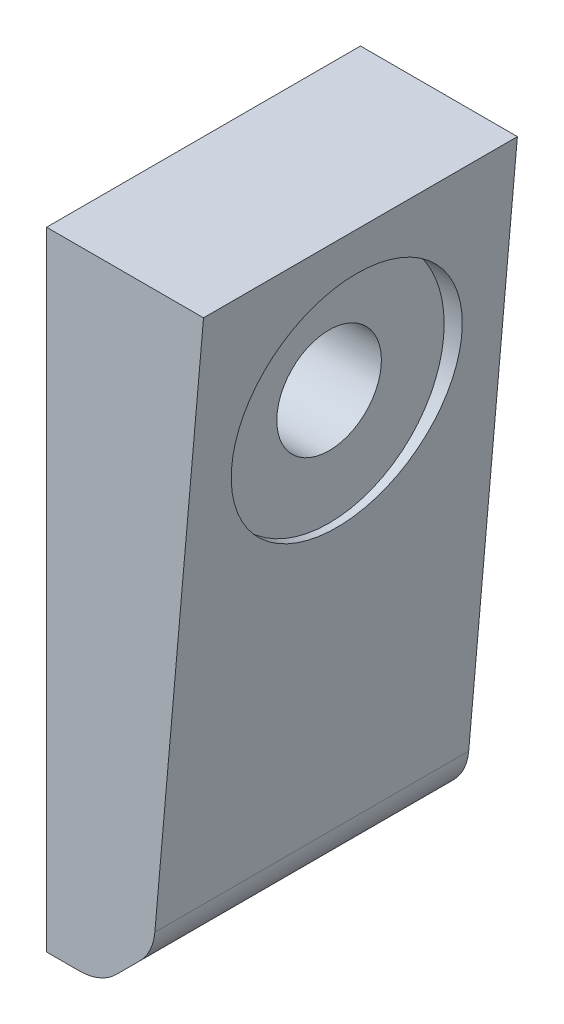
ISO-10303-21;
HEADER;
FILE_DESCRIPTION(('STEP AP214'),'2;1');
FILE_NAME('part.step','',(''),(''),'','','');
FILE_SCHEMA(('AUTOMOTIVE_DESIGN { 1 0 10303 214 1 1 1 1 }'));
ENDSEC;
DATA;
#1=APPLICATION_CONTEXT('core data for automotive mechanical design processes');
#2=APPLICATION_PROTOCOL_DEFINITION('international standard','automotive_design',2000,#1);
#3=PRODUCT_CONTEXT('',#1,'mechanical');
#4=PRODUCT('Part','Part','',(#3));
#5=PRODUCT_RELATED_PRODUCT_CATEGORY('part','',(#4));
#6=PRODUCT_DEFINITION_FORMATION('','',#4);
#7=PRODUCT_DEFINITION_CONTEXT('part definition',#1,'design');
#8=PRODUCT_DEFINITION('design','',#6,#7);
#9=PRODUCT_DEFINITION_SHAPE('','',#8);
#10=(LENGTH_UNIT() NAMED_UNIT(*) SI_UNIT(.MILLI.,.METRE.));
#11=(NAMED_UNIT(*) PLANE_ANGLE_UNIT() SI_UNIT($,.RADIAN.));
#12=(NAMED_UNIT(*) SI_UNIT($,.STERADIAN.) SOLID_ANGLE_UNIT());
#13=UNCERTAINTY_MEASURE_WITH_UNIT(LENGTH_MEASURE(1.E-05),#10,'distance_accuracy_value','');
#14=(GEOMETRIC_REPRESENTATION_CONTEXT(3) GLOBAL_UNCERTAINTY_ASSIGNED_CONTEXT((#13)) GLOBAL_UNIT_ASSIGNED_CONTEXT((#10,
#11,#12)) REPRESENTATION_CONTEXT('',''));
#15=CARTESIAN_POINT('',(0.,0.,0.));
#16=DIRECTION('',(0.,0.,1.));
#17=DIRECTION('',(1.,0.,0.));
#18=AXIS2_PLACEMENT_3D('',#15,#16,#17);
#19=CARTESIAN_POINT('',(10.346733986602,-53.187073911804,30.));
#20=DIRECTION('',(-0.996194698091746,0.087155742747653,0.));
#21=DIRECTION('',(-0.087155742747653,-0.996194698091746,0.));
#22=AXIS2_PLACEMENT_3D('',#19,#20,#21);
#23=PLANE('',#22);
#24=DIRECTION('',(0.087155742747653,0.996194698091746,0.));
#25=VECTOR('',#24,1.);
#26=CARTESIAN_POINT('',(10.346733986602,-53.187073911804,0.));
#27=LINE('',#26,#25);
#28=CARTESIAN_POINT('',(10.346733986602,-53.187073911804,0.));
#29=VERTEX_POINT('',#28);
#30=CARTESIAN_POINT('',(15.,0.,0.));
#31=VERTEX_POINT('',#30);
#32=EDGE_CURVE('E88',#29,#31,#27,.T.);
#33=ORIENTED_EDGE('',*,*,#32,.T.);
#34=DIRECTION('',(0.,0.,-1.));
#35=VECTOR('',#34,1.);
#36=CARTESIAN_POINT('',(15.,0.,30.));
#37=LINE('',#36,#35);
#38=CARTESIAN_POINT('',(15.,0.,30.));
#39=VERTEX_POINT('',#38);
#40=EDGE_CURVE('E126',#39,#31,#37,.T.);
#41=ORIENTED_EDGE('',*,*,#40,.F.);
#42=DIRECTION('',(0.087155742747653,0.996194698091746,0.));
#43=VECTOR('',#42,1.);
#44=CARTESIAN_POINT('',(10.346733986602,-53.187073911804,30.));
#45=LINE('',#44,#43);
#46=CARTESIAN_POINT('',(10.346733986602,-53.187073911804,30.));
#47=VERTEX_POINT('',#46);
#48=EDGE_CURVE('E56',#47,#39,#45,.T.);
#49=ORIENTED_EDGE('',*,*,#48,.F.);
#50=DIRECTION('',(0.,0.,-1.));
#51=VECTOR('',#50,1.);
#52=CARTESIAN_POINT('',(10.346733986602,-53.187073911804,30.));
#53=LINE('',#52,#51);
#54=EDGE_CURVE('E122',#47,#29,#53,.T.);
#55=ORIENTED_EDGE('',*,*,#54,.T.);
#56=EDGE_LOOP('',(#33,#41,#49,#55));
#57=FACE_BOUND('',#56,.T.);
#58=CARTESIAN_POINT('',(13.6876700471112,-15.,15.));
#59=DIRECTION('',(-0.996194698091746,0.087155742747653,0.));
#60=DIRECTION('',(0.087155742747653,0.996194698091746,0.));
#61=AXIS2_PLACEMENT_3D('',#58,#59,#60);
#62=ELLIPSE('',#61,11.0420182129768,11.);
#63=CARTESIAN_POINT('',(14.6500453458963,-3.99999999999999,15.));
#64=VERTEX_POINT('',#63);
#65=EDGE_CURVE('E41',#64,#64,#62,.F.);
#66=ORIENTED_EDGE('',*,*,#65,.F.);
#67=EDGE_LOOP('',(#66));
#68=FACE_BOUND('',#67,.T.);
#69=ADVANCED_FACE('F37',(#57,#68),#23,.F.);
#70=CARTESIAN_POINT('',(0.,0.,30.));
#71=DIRECTION('',(0.,-1.,0.));
#72=DIRECTION('',(0.,0.,-1.));
#73=AXIS2_PLACEMENT_3D('',#70,#71,#72);
#74=PLANE('',#73);
#75=DIRECTION('',(-1.,0.,0.));
#76=VECTOR('',#75,1.);
#77=CARTESIAN_POINT('',(0.,0.,0.));
#78=LINE('',#77,#76);
#79=CARTESIAN_POINT('',(0.,0.,0.));
#80=VERTEX_POINT('',#79);
#81=EDGE_CURVE('E130',#31,#80,#78,.T.);
#82=ORIENTED_EDGE('',*,*,#81,.T.);
#83=DIRECTION('',(0.,0.,-1.));
#84=VECTOR('',#83,1.);
#85=CARTESIAN_POINT('',(0.,0.,30.));
#86=LINE('',#85,#84);
#87=CARTESIAN_POINT('',(0.,0.,30.));
#88=VERTEX_POINT('',#87);
#89=EDGE_CURVE('E11',#88,#80,#86,.T.);
#90=ORIENTED_EDGE('',*,*,#89,.F.);
#91=DIRECTION('',(-1.,0.,0.));
#92=VECTOR('',#91,1.);
#93=CARTESIAN_POINT('',(0.,0.,30.));
#94=LINE('',#93,#92);
#95=EDGE_CURVE('E143',#39,#88,#94,.T.);
#96=ORIENTED_EDGE('',*,*,#95,.F.);
#97=ORIENTED_EDGE('',*,*,#40,.T.);
#98=EDGE_LOOP('',(#82,#90,#96,#97));
#99=FACE_BOUND('',#98,.T.);
#100=ADVANCED_FACE('F39',(#99),#74,.F.);
#101=CARTESIAN_POINT('',(0.,0.,30.));
#102=DIRECTION('',(1.,0.,0.));
#103=DIRECTION('',(0.,1.,0.));
#104=AXIS2_PLACEMENT_3D('',#101,#102,#103);
#105=PLANE('',#104);
#106=CARTESIAN_POINT('',(0.,-15.,15.));
#107=DIRECTION('',(-1.,0.,0.));
#108=DIRECTION('',(0.,-1.,0.));
#109=AXIS2_PLACEMENT_3D('',#106,#107,#108);
#110=CIRCLE('',#109,5.);
#111=CARTESIAN_POINT('',(0.,-20.,15.));
#112=VERTEX_POINT('',#111);
#113=EDGE_CURVE('E134',#112,#112,#110,.T.);
#114=ORIENTED_EDGE('',*,*,#113,.F.);
#115=EDGE_LOOP('',(#114));
#116=FACE_BOUND('',#115,.T.);
#117=DIRECTION('',(0.,-1.,0.));
#118=VECTOR('',#117,1.);
#119=CARTESIAN_POINT('',(0.,0.,0.));
#120=LINE('',#119,#118);
#121=CARTESIAN_POINT('',(0.,-60.,0.));
#122=VERTEX_POINT('',#121);
#123=EDGE_CURVE('E133',#80,#122,#120,.T.);
#124=ORIENTED_EDGE('',*,*,#123,.T.);
#125=DIRECTION('',(0.,0.,-1.));
#126=VECTOR('',#125,1.);
#127=CARTESIAN_POINT('',(0.,-60.,30.));
#128=LINE('',#127,#126);
#129=CARTESIAN_POINT('',(0.,-60.,30.));
#130=VERTEX_POINT('',#129);
#131=EDGE_CURVE('E47',#130,#122,#128,.T.);
#132=ORIENTED_EDGE('',*,*,#131,.F.);
#133=DIRECTION('',(0.,-1.,0.));
#134=VECTOR('',#133,1.);
#135=CARTESIAN_POINT('',(0.,0.,30.));
#136=LINE('',#135,#134);
#137=EDGE_CURVE('E96',#88,#130,#136,.T.);
#138=ORIENTED_EDGE('',*,*,#137,.F.);
#139=ORIENTED_EDGE('',*,*,#89,.T.);
#140=EDGE_LOOP('',(#124,#132,#138,#139));
#141=FACE_BOUND('',#140,.T.);
#142=ADVANCED_FACE('F211',(#116,#141),#105,.F.);
#143=CARTESIAN_POINT('',(0.,-60.,30.));
#144=DIRECTION('',(0.,1.,0.));
#145=DIRECTION('',(0.,0.,1.));
#146=AXIS2_PLACEMENT_3D('',#143,#144,#145);
#147=PLANE('',#146);
#148=DIRECTION('',(1.,0.,0.));
#149=VECTOR('',#148,1.);
#150=CARTESIAN_POINT('',(0.,-60.,0.));
#151=LINE('',#150,#149);
#152=CARTESIAN_POINT('',(3.11705569420901,-60.,0.));
#153=VERTEX_POINT('',#152);
#154=EDGE_CURVE('E136',#122,#153,#151,.T.);
#155=ORIENTED_EDGE('',*,*,#154,.T.);
#156=DIRECTION('',(0.,0.,-1.));
#157=VECTOR('',#156,1.);
#158=CARTESIAN_POINT('',(3.11705569420901,-60.,30.));
#159=LINE('',#158,#157);
#160=CARTESIAN_POINT('',(3.11705569420901,-60.,30.));
#161=VERTEX_POINT('',#160);
#162=EDGE_CURVE('E147',#161,#153,#159,.T.);
#163=ORIENTED_EDGE('',*,*,#162,.F.);
#164=DIRECTION('',(1.,0.,0.));
#165=VECTOR('',#164,1.);
#166=CARTESIAN_POINT('',(0.,-60.,30.));
#167=LINE('',#166,#165);
#168=EDGE_CURVE('E166',#130,#161,#167,.T.);
#169=ORIENTED_EDGE('',*,*,#168,.F.);
#170=ORIENTED_EDGE('',*,*,#131,.T.);
#171=EDGE_LOOP('',(#155,#163,#169,#170));
#172=FACE_BOUND('',#171,.T.);
#173=ADVANCED_FACE('F170',(#172),#147,.F.);
#174=CARTESIAN_POINT('',(3.11705569420901,-55.,30.));
#175=DIRECTION('',(0.,0.,-1.));
#176=DIRECTION('',(-1.,0.,0.));
#177=AXIS2_PLACEMENT_3D('',#174,#175,#176);
#178=CYLINDRICAL_SURFACE('',#177,4.99999999999999);
#179=CARTESIAN_POINT('',(3.11705569420901,-55.,0.));
#180=DIRECTION('',(0.,0.,1.));
#181=DIRECTION('',(-1.,0.,0.));
#182=AXIS2_PLACEMENT_3D('',#179,#180,#181);
#183=CIRCLE('',#182,4.99999999999999);
#184=CARTESIAN_POINT('',(6.65258960014175,-58.5355339059327,0.));
#185=VERTEX_POINT('',#184);
#186=EDGE_CURVE('E138',#153,#185,#183,.T.);
#187=ORIENTED_EDGE('',*,*,#186,.T.);
#188=DIRECTION('',(0.,0.,-1.));
#189=VECTOR('',#188,1.);
#190=CARTESIAN_POINT('',(6.65258960014175,-58.5355339059327,30.));
#191=LINE('',#190,#189);
#192=CARTESIAN_POINT('',(6.65258960014175,-58.5355339059327,30.));
#193=VERTEX_POINT('',#192);
#194=EDGE_CURVE('E121',#193,#185,#191,.T.);
#195=ORIENTED_EDGE('',*,*,#194,.F.);
#196=CARTESIAN_POINT('',(3.11705569420901,-55.,30.));
#197=DIRECTION('',(0.,0.,1.));
#198=DIRECTION('',(-1.,0.,0.));
#199=AXIS2_PLACEMENT_3D('',#196,#197,#198);
#200=CIRCLE('',#199,4.99999999999999);
#201=EDGE_CURVE('E112',#161,#193,#200,.T.);
#202=ORIENTED_EDGE('',*,*,#201,.F.);
#203=ORIENTED_EDGE('',*,*,#162,.T.);
#204=EDGE_LOOP('',(#187,#195,#202,#203));
#205=FACE_BOUND('',#204,.T.);
#206=ADVANCED_FACE('F174',(#205),#178,.T.);
#207=CARTESIAN_POINT('',(6.65258960014175,-58.5355339059327,30.));
#208=DIRECTION('',(-0.707106781186549,0.707106781186546,0.));
#209=DIRECTION('',(-0.707106781186546,-0.707106781186549,0.));
#210=AXIS2_PLACEMENT_3D('',#207,#208,#209);
#211=PLANE('',#210);
#212=DIRECTION('',(0.707106781186546,0.707106781186549,0.));
#213=VECTOR('',#212,1.);
#214=CARTESIAN_POINT('',(6.65258960014175,-58.5355339059327,0.));
#215=LINE('',#214,#213);
#216=CARTESIAN_POINT('',(8.90129440207602,-56.2868291039984,0.));
#217=VERTEX_POINT('',#216);
#218=EDGE_CURVE('E120',#185,#217,#215,.T.);
#219=ORIENTED_EDGE('',*,*,#218,.T.);
#220=DIRECTION('',(0.,0.,-1.));
#221=VECTOR('',#220,1.);
#222=CARTESIAN_POINT('',(8.90129440207602,-56.2868291039984,30.));
#223=LINE('',#222,#221);
#224=CARTESIAN_POINT('',(8.90129440207602,-56.2868291039984,30.));
#225=VERTEX_POINT('',#224);
#226=EDGE_CURVE('E117',#225,#217,#223,.T.);
#227=ORIENTED_EDGE('',*,*,#226,.F.);
#228=DIRECTION('',(0.707106781186546,0.707106781186549,0.));
#229=VECTOR('',#228,1.);
#230=CARTESIAN_POINT('',(6.65258960014175,-58.5355339059327,30.));
#231=LINE('',#230,#229);
#232=EDGE_CURVE('E106',#193,#225,#231,.T.);
#233=ORIENTED_EDGE('',*,*,#232,.F.);
#234=ORIENTED_EDGE('',*,*,#194,.T.);
#235=EDGE_LOOP('',(#219,#227,#233,#234));
#236=FACE_BOUND('',#235,.T.);
#237=ADVANCED_FACE('F118',(#236),#211,.F.);
#238=CARTESIAN_POINT('',(5.36576049614327,-52.7512951980657,30.));
#239=DIRECTION('',(0.,0.,-1.));
#240=DIRECTION('',(-1.,0.,0.));
#241=AXIS2_PLACEMENT_3D('',#238,#239,#240);
#242=CYLINDRICAL_SURFACE('',#241,5.);
#243=CARTESIAN_POINT('',(5.36576049614327,-52.7512951980657,0.));
#244=DIRECTION('',(0.,0.,1.));
#245=DIRECTION('',(-1.,0.,0.));
#246=AXIS2_PLACEMENT_3D('',#243,#244,#245);
#247=CIRCLE('',#246,5.);
#248=EDGE_CURVE('E82',#217,#29,#247,.T.);
#249=ORIENTED_EDGE('',*,*,#248,.T.);
#250=ORIENTED_EDGE('',*,*,#54,.F.);
#251=CARTESIAN_POINT('',(5.36576049614327,-52.7512951980657,30.));
#252=DIRECTION('',(0.,0.,1.));
#253=DIRECTION('',(-1.,0.,0.));
#254=AXIS2_PLACEMENT_3D('',#251,#252,#253);
#255=CIRCLE('',#254,5.);
#256=EDGE_CURVE('E110',#225,#47,#255,.T.);
#257=ORIENTED_EDGE('',*,*,#256,.F.);
#258=ORIENTED_EDGE('',*,*,#226,.T.);
#259=EDGE_LOOP('',(#249,#250,#257,#258));
#260=FACE_BOUND('',#259,.T.);
#261=ADVANCED_FACE('F124',(#260),#242,.T.);
#262=CARTESIAN_POINT('',(5.36576049614327,-52.7512951980657,30.));
#263=DIRECTION('',(0.,0.,-1.));
#264=DIRECTION('',(-1.,0.,0.));
#265=AXIS2_PLACEMENT_3D('',#262,#263,#264);
#266=PLANE('',#265);
#267=ORIENTED_EDGE('',*,*,#95,.T.);
#268=ORIENTED_EDGE('',*,*,#137,.T.);
#269=ORIENTED_EDGE('',*,*,#168,.T.);
#270=ORIENTED_EDGE('',*,*,#201,.T.);
#271=ORIENTED_EDGE('',*,*,#232,.T.);
#272=ORIENTED_EDGE('',*,*,#256,.T.);
#273=ORIENTED_EDGE('',*,*,#48,.T.);
#274=EDGE_LOOP('',(#267,#268,#269,#270,#271,#272,#273));
#275=FACE_BOUND('',#274,.T.);
#276=ADVANCED_FACE('F108',(#275),#266,.F.);
#277=CARTESIAN_POINT('',(5.36576049614327,-52.7512951980657,0.));
#278=DIRECTION('',(0.,0.,-1.));
#279=DIRECTION('',(-1.,0.,0.));
#280=AXIS2_PLACEMENT_3D('',#277,#278,#279);
#281=PLANE('',#280);
#282=ORIENTED_EDGE('',*,*,#81,.F.);
#283=ORIENTED_EDGE('',*,*,#32,.F.);
#284=ORIENTED_EDGE('',*,*,#248,.F.);
#285=ORIENTED_EDGE('',*,*,#218,.F.);
#286=ORIENTED_EDGE('',*,*,#186,.F.);
#287=ORIENTED_EDGE('',*,*,#154,.F.);
#288=ORIENTED_EDGE('',*,*,#123,.F.);
#289=EDGE_LOOP('',(#282,#283,#284,#285,#286,#287,#288));
#290=FACE_BOUND('',#289,.T.);
#291=ADVANCED_FACE('F177',(#290),#281,.T.);
#292=CARTESIAN_POINT('',(21.,-15.,15.));
#293=DIRECTION('',(-1.,0.,0.));
#294=DIRECTION('',(0.,-1.,0.));
#295=AXIS2_PLACEMENT_3D('',#292,#293,#294);
#296=CYLINDRICAL_SURFACE('',#295,5.);
#297=CARTESIAN_POINT('',(12.,-15.,15.));
#298=DIRECTION('',(-1.,0.,0.));
#299=DIRECTION('',(0.,-1.,0.));
#300=AXIS2_PLACEMENT_3D('',#297,#298,#299);
#301=CIRCLE('',#300,5.);
#302=CARTESIAN_POINT('',(12.,-20.,15.));
#303=VERTEX_POINT('',#302);
#304=EDGE_CURVE('E151',#303,#303,#301,.F.);
#305=ORIENTED_EDGE('',*,*,#304,.T.);
#306=EDGE_LOOP('',(#305));
#307=FACE_BOUND('',#306,.T.);
#308=ORIENTED_EDGE('',*,*,#113,.T.);
#309=EDGE_LOOP('',(#308));
#310=FACE_BOUND('',#309,.T.);
#311=ADVANCED_FACE('F189',(#307,#310),#296,.F.);
#312=CARTESIAN_POINT('',(12.,-15.,15.));
#313=DIRECTION('',(1.,0.,0.));
#314=DIRECTION('',(0.,1.,0.));
#315=AXIS2_PLACEMENT_3D('',#312,#313,#314);
#316=CYLINDRICAL_SURFACE('',#315,11.);
#317=CARTESIAN_POINT('',(12.,-15.,15.));
#318=DIRECTION('',(-1.,0.,0.));
#319=DIRECTION('',(0.,-1.,0.));
#320=AXIS2_PLACEMENT_3D('',#317,#318,#319);
#321=CIRCLE('',#320,11.);
#322=CARTESIAN_POINT('',(12.,-26.,15.));
#323=VERTEX_POINT('',#322);
#324=EDGE_CURVE('E153',#323,#323,#321,.T.);
#325=ORIENTED_EDGE('',*,*,#324,.T.);
#326=EDGE_LOOP('',(#325));
#327=FACE_BOUND('',#326,.T.);
#328=ORIENTED_EDGE('',*,*,#65,.T.);
#329=EDGE_LOOP('',(#328));
#330=FACE_BOUND('',#329,.T.);
#331=ADVANCED_FACE('F186',(#327,#330),#316,.F.);
#332=CARTESIAN_POINT('',(12.,-15.,15.));
#333=DIRECTION('',(-1.,0.,0.));
#334=DIRECTION('',(0.,-1.,0.));
#335=AXIS2_PLACEMENT_3D('',#332,#333,#334);
#336=PLANE('',#335);
#337=ORIENTED_EDGE('',*,*,#324,.F.);
#338=EDGE_LOOP('',(#337));
#339=FACE_BOUND('',#338,.T.);
#340=ORIENTED_EDGE('',*,*,#304,.F.);
#341=EDGE_LOOP('',(#340));
#342=FACE_BOUND('',#341,.T.);
#343=ADVANCED_FACE('F188',(#339,#342),#336,.F.);
#344=CLOSED_SHELL('',(#69,#100,#142,#173,#206,#237,#261,#276,#291,#311,#331,#343));
#345=MANIFOLD_SOLID_BREP('B2',#344);
#346=ADVANCED_BREP_SHAPE_REPRESENTATION('',(#18,#345),#14);
#347=SHAPE_DEFINITION_REPRESENTATION(#9,#346);
ENDSEC;
END-ISO-10303-21;
